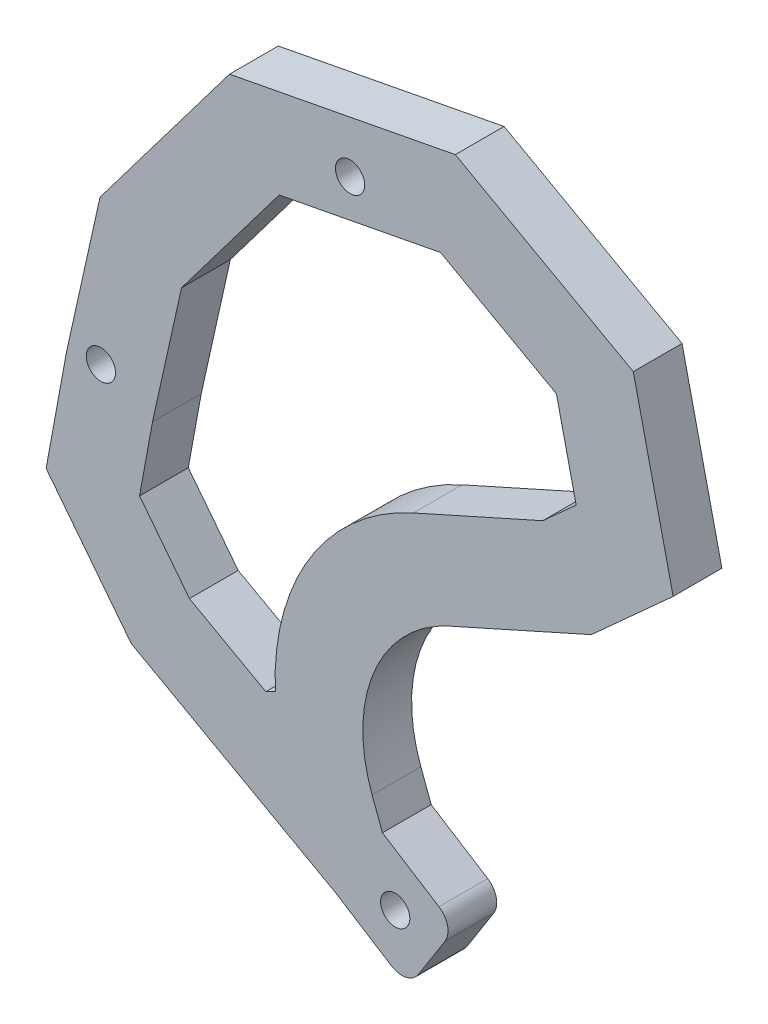
ISO-10303-21;
HEADER;
FILE_DESCRIPTION(('STEP AP214'),'2;1');
FILE_NAME('part.step','',(''),(''),'','','');
FILE_SCHEMA(('AUTOMOTIVE_DESIGN { 1 0 10303 214 1 1 1 1 }'));
ENDSEC;
DATA;
#1=APPLICATION_CONTEXT('core data for automotive mechanical design processes');
#2=APPLICATION_PROTOCOL_DEFINITION('international standard','automotive_design',2000,#1);
#3=PRODUCT_CONTEXT('',#1,'mechanical');
#4=PRODUCT('Part','Part','',(#3));
#5=PRODUCT_RELATED_PRODUCT_CATEGORY('part','',(#4));
#6=PRODUCT_DEFINITION_FORMATION('','',#4);
#7=PRODUCT_DEFINITION_CONTEXT('part definition',#1,'design');
#8=PRODUCT_DEFINITION('design','',#6,#7);
#9=PRODUCT_DEFINITION_SHAPE('','',#8);
#10=(LENGTH_UNIT() NAMED_UNIT(*) SI_UNIT(.MILLI.,.METRE.));
#11=(NAMED_UNIT(*) PLANE_ANGLE_UNIT() SI_UNIT($,.RADIAN.));
#12=(NAMED_UNIT(*) SI_UNIT($,.STERADIAN.) SOLID_ANGLE_UNIT());
#13=UNCERTAINTY_MEASURE_WITH_UNIT(LENGTH_MEASURE(1.E-05),#10,'distance_accuracy_value','');
#14=(GEOMETRIC_REPRESENTATION_CONTEXT(3) GLOBAL_UNCERTAINTY_ASSIGNED_CONTEXT((#13)) GLOBAL_UNIT_ASSIGNED_CONTEXT((#10,
#11,#12)) REPRESENTATION_CONTEXT('',''));
#15=CARTESIAN_POINT('',(0.,0.,0.));
#16=DIRECTION('',(0.,0.,1.));
#17=DIRECTION('',(1.,0.,0.));
#18=AXIS2_PLACEMENT_3D('',#15,#16,#17);
#19=CARTESIAN_POINT('',(3.11076101761809,-23.2311358919066,-22.));
#20=DIRECTION('',(-0.788604453813299,-0.614900817551765,0.));
#21=DIRECTION('',(0.614900817551765,-0.788604453813299,0.));
#22=AXIS2_PLACEMENT_3D('',#19,#20,#21);
#23=PLANE('',#22);
#24=DIRECTION('',(-0.614900817551765,0.788604453813299,0.));
#25=VECTOR('',#24,1.);
#26=CARTESIAN_POINT('',(3.11076101761809,-23.2311358919066,-27.));
#27=LINE('',#26,#25);
#28=CARTESIAN_POINT('',(3.11076101761809,-23.2311358919066,-27.));
#29=VERTEX_POINT('',#28);
#30=CARTESIAN_POINT('',(-5.61594193316147,-12.0392223057597,-27.));
#31=VERTEX_POINT('',#30);
#32=EDGE_CURVE('E397',#29,#31,#27,.T.);
#33=ORIENTED_EDGE('',*,*,#32,.F.);
#34=DIRECTION('',(0.,0.,-1.));
#35=VECTOR('',#34,1.);
#36=CARTESIAN_POINT('',(3.11076101761809,-23.2311358919066,-22.));
#37=LINE('',#36,#35);
#38=CARTESIAN_POINT('',(3.11076101761809,-23.2311358919066,-22.));
#39=VERTEX_POINT('',#38);
#40=EDGE_CURVE('E517',#39,#29,#37,.T.);
#41=ORIENTED_EDGE('',*,*,#40,.F.);
#42=DIRECTION('',(-0.614900817551765,0.788604453813299,0.));
#43=VECTOR('',#42,1.);
#44=CARTESIAN_POINT('',(3.11076101761809,-23.2311358919066,-22.));
#45=LINE('',#44,#43);
#46=CARTESIAN_POINT('',(-5.61594193316147,-12.0392223057597,-22.));
#47=VERTEX_POINT('',#46);
#48=EDGE_CURVE('E401',#39,#47,#45,.T.);
#49=ORIENTED_EDGE('',*,*,#48,.T.);
#50=DIRECTION('',(0.,0.,-1.));
#51=VECTOR('',#50,1.);
#52=CARTESIAN_POINT('',(-5.61594193316147,-12.0392223057597,-22.));
#53=LINE('',#52,#51);
#54=EDGE_CURVE('E459',#47,#31,#53,.T.);
#55=ORIENTED_EDGE('',*,*,#54,.T.);
#56=EDGE_LOOP('',(#33,#41,#49,#55));
#57=FACE_BOUND('',#56,.T.);
#58=ADVANCED_FACE('F41',(#57),#23,.T.);
#59=CARTESIAN_POINT('',(24.0092428157621,-34.8487399241226,-22.));
#60=DIRECTION('',(-0.485877374532499,-0.874026988666486,0.));
#61=DIRECTION('',(0.874026988666486,-0.485877374532499,0.));
#62=AXIS2_PLACEMENT_3D('',#59,#60,#61);
#63=PLANE('',#62);
#64=DIRECTION('',(-0.874026988666486,0.485877374532499,0.));
#65=VECTOR('',#64,1.);
#66=CARTESIAN_POINT('',(24.0092428157621,-34.8487399241226,-27.));
#67=LINE('',#66,#65);
#68=CARTESIAN_POINT('',(24.0092428157621,-34.8487399241226,-27.));
#69=VERTEX_POINT('',#68);
#70=EDGE_CURVE('E406',#69,#29,#67,.T.);
#71=ORIENTED_EDGE('',*,*,#70,.F.);
#72=DIRECTION('',(0.,0.,-1.));
#73=VECTOR('',#72,1.);
#74=CARTESIAN_POINT('',(24.0092428157621,-34.8487399241226,-22.));
#75=LINE('',#74,#73);
#76=CARTESIAN_POINT('',(24.0092428157621,-34.8487399241226,-22.));
#77=VERTEX_POINT('',#76);
#78=EDGE_CURVE('E521',#77,#69,#75,.T.);
#79=ORIENTED_EDGE('',*,*,#78,.F.);
#80=DIRECTION('',(-0.874026988666486,0.485877374532499,0.));
#81=VECTOR('',#80,1.);
#82=CARTESIAN_POINT('',(24.0092428157621,-34.8487399241226,-22.));
#83=LINE('',#82,#81);
#84=EDGE_CURVE('E455',#77,#39,#83,.T.);
#85=ORIENTED_EDGE('',*,*,#84,.T.);
#86=ORIENTED_EDGE('',*,*,#40,.T.);
#87=EDGE_LOOP('',(#71,#79,#85,#86));
#88=FACE_BOUND('',#87,.T.);
#89=ADVANCED_FACE('F598',(#88),#63,.T.);
#90=CARTESIAN_POINT('',(24.0092428157621,-34.8487399241226,-22.));
#91=DIRECTION('',(-0.535022818922781,-0.844837607609842,0.));
#92=DIRECTION('',(0.844837607609842,-0.535022818922781,0.));
#93=AXIS2_PLACEMENT_3D('',#90,#91,#92);
#94=PLANE('',#93);
#95=DIRECTION('',(-0.844837607609842,0.535022818922781,0.));
#96=VECTOR('',#95,1.);
#97=CARTESIAN_POINT('',(24.0092428157621,-34.8487399241226,-27.));
#98=LINE('',#97,#96);
#99=CARTESIAN_POINT('',(29.8035032170878,-38.5181569879065,-27.));
#100=VERTEX_POINT('',#99);
#101=EDGE_CURVE('E511',#100,#69,#98,.T.);
#102=ORIENTED_EDGE('',*,*,#101,.F.);
#103=DIRECTION('',(0.,0.,-1.));
#104=VECTOR('',#103,1.);
#105=CARTESIAN_POINT('',(29.8035032170878,-38.5181569879065,-22.));
#106=LINE('',#105,#104);
#107=CARTESIAN_POINT('',(29.8035032170878,-38.5181569879065,-22.));
#108=VERTEX_POINT('',#107);
#109=EDGE_CURVE('E11',#100,#108,#106,.F.);
#110=ORIENTED_EDGE('',*,*,#109,.T.);
#111=DIRECTION('',(-0.844837607609842,0.535022818922781,0.));
#112=VECTOR('',#111,1.);
#113=CARTESIAN_POINT('',(24.0092428157621,-34.8487399241226,-22.));
#114=LINE('',#113,#112);
#115=EDGE_CURVE('E452',#108,#77,#114,.T.);
#116=ORIENTED_EDGE('',*,*,#115,.T.);
#117=ORIENTED_EDGE('',*,*,#78,.T.);
#118=EDGE_LOOP('',(#102,#110,#116,#117));
#119=FACE_BOUND('',#118,.T.);
#120=ADVANCED_FACE('F593',(#119),#94,.T.);
#121=CARTESIAN_POINT('',(36.3629028768119,-31.8985748119372,-22.));
#122=DIRECTION('',(0.844837607609846,-0.535022818922775,0.));
#123=DIRECTION('',(0.535022818922775,0.844837607609846,0.));
#124=AXIS2_PLACEMENT_3D('',#121,#122,#123);
#125=PLANE('',#124);
#126=DIRECTION('',(-0.535022818922775,-0.844837607609846,0.));
#127=VECTOR('',#126,1.);
#128=CARTESIAN_POINT('',(36.3629028768119,-31.8985748119372,-27.));
#129=LINE('',#128,#127);
#130=CARTESIAN_POINT('',(35.2928572389663,-33.5882500271568,-27.));
#131=VERTEX_POINT('',#130);
#132=CARTESIAN_POINT('',(32.5632240701531,-37.8985274105324,-27.));
#133=VERTEX_POINT('',#132);
#134=EDGE_CURVE('E507',#131,#133,#129,.T.);
#135=ORIENTED_EDGE('',*,*,#134,.F.);
#136=DIRECTION('',(0.,0.,-1.));
#137=VECTOR('',#136,1.);
#138=CARTESIAN_POINT('',(35.2928572389663,-33.5882500271568,-22.));
#139=LINE('',#138,#137);
#140=CARTESIAN_POINT('',(35.2928572389663,-33.5882500271568,-22.));
#141=VERTEX_POINT('',#140);
#142=EDGE_CURVE('E571',#131,#141,#139,.F.);
#143=ORIENTED_EDGE('',*,*,#142,.T.);
#144=DIRECTION('',(-0.535022818922775,-0.844837607609846,0.));
#145=VECTOR('',#144,1.);
#146=CARTESIAN_POINT('',(36.3629028768119,-31.8985748119372,-22.));
#147=LINE('',#146,#145);
#148=CARTESIAN_POINT('',(32.5632240701531,-37.8985274105324,-22.));
#149=VERTEX_POINT('',#148);
#150=EDGE_CURVE('E449',#141,#149,#147,.T.);
#151=ORIENTED_EDGE('',*,*,#150,.T.);
#152=DIRECTION('',(0.,0.,-1.));
#153=VECTOR('',#152,1.);
#154=CARTESIAN_POINT('',(32.5632240701531,-37.8985274105324,-22.));
#155=LINE('',#154,#153);
#156=EDGE_CURVE('E567',#149,#133,#155,.T.);
#157=ORIENTED_EDGE('',*,*,#156,.T.);
#158=EDGE_LOOP('',(#135,#143,#151,#157));
#159=FACE_BOUND('',#158,.T.);
#160=ADVANCED_FACE('F590',(#159),#125,.T.);
#161=CARTESIAN_POINT('',(28.8789672602665,-27.1591121103077,-22.));
#162=DIRECTION('',(0.535022818922781,0.844837607609842,0.));
#163=DIRECTION('',(-0.844837607609842,0.535022818922781,0.));
#164=AXIS2_PLACEMENT_3D('',#161,#162,#163);
#165=PLANE('',#164);
#166=DIRECTION('',(0.844837607609842,-0.535022818922781,0.));
#167=VECTOR('',#166,1.);
#168=CARTESIAN_POINT('',(28.8789672602665,-27.1591121103077,-22.));
#169=LINE('',#168,#167);
#170=CARTESIAN_POINT('',(28.8789672602665,-27.1591121103077,-22.));
#171=VERTEX_POINT('',#170);
#172=CARTESIAN_POINT('',(34.6732276615922,-30.8285291740916,-22.));
#173=VERTEX_POINT('',#172);
#174=EDGE_CURVE('E445',#171,#173,#169,.T.);
#175=ORIENTED_EDGE('',*,*,#174,.T.);
#176=DIRECTION('',(0.,0.,-1.));
#177=VECTOR('',#176,1.);
#178=CARTESIAN_POINT('',(34.6732276615922,-30.8285291740916,-22.));
#179=LINE('',#178,#177);
#180=CARTESIAN_POINT('',(34.6732276615922,-30.8285291740916,-27.));
#181=VERTEX_POINT('',#180);
#182=EDGE_CURVE('E520',#173,#181,#179,.T.);
#183=ORIENTED_EDGE('',*,*,#182,.T.);
#184=DIRECTION('',(0.844837607609842,-0.535022818922781,0.));
#185=VECTOR('',#184,1.);
#186=CARTESIAN_POINT('',(28.8789672602665,-27.1591121103077,-27.));
#187=LINE('',#186,#185);
#188=CARTESIAN_POINT('',(28.8789672602665,-27.1591121103077,-27.));
#189=VERTEX_POINT('',#188);
#190=EDGE_CURVE('E503',#189,#181,#187,.T.);
#191=ORIENTED_EDGE('',*,*,#190,.F.);
#192=DIRECTION('',(0.,0.,-1.));
#193=VECTOR('',#192,1.);
#194=CARTESIAN_POINT('',(28.8789672602665,-27.1591121103077,-22.));
#195=LINE('',#194,#193);
#196=EDGE_CURVE('E525',#171,#189,#195,.T.);
#197=ORIENTED_EDGE('',*,*,#196,.F.);
#198=EDGE_LOOP('',(#175,#183,#191,#197));
#199=FACE_BOUND('',#198,.T.);
#200=ADVANCED_FACE('F583',(#199),#165,.T.);
#201=CARTESIAN_POINT('',(28.8789672602665,-27.1591121103077,-22.));
#202=DIRECTION('',(0.936590996501724,0.350424464431221,0.));
#203=DIRECTION('',(-0.350424464431221,0.936590996501724,0.));
#204=AXIS2_PLACEMENT_3D('',#201,#202,#203);
#205=PLANE('',#204);
#206=DIRECTION('',(0.350424464431221,-0.936590996501724,0.));
#207=VECTOR('',#206,1.);
#208=CARTESIAN_POINT('',(28.8789672602665,-27.1591121103077,-27.));
#209=LINE('',#208,#207);
#210=CARTESIAN_POINT('',(27.8173680449634,-24.3217409565558,-27.));
#211=VERTEX_POINT('',#210);
#212=EDGE_CURVE('E499',#211,#189,#209,.T.);
#213=ORIENTED_EDGE('',*,*,#212,.F.);
#214=DIRECTION('',(0.,0.,-1.));
#215=VECTOR('',#214,1.);
#216=CARTESIAN_POINT('',(27.8173680449634,-24.3217409565558,-22.));
#217=LINE('',#216,#215);
#218=CARTESIAN_POINT('',(27.8173680449634,-24.3217409565558,-22.));
#219=VERTEX_POINT('',#218);
#220=EDGE_CURVE('E528',#219,#211,#217,.T.);
#221=ORIENTED_EDGE('',*,*,#220,.F.);
#222=DIRECTION('',(0.350424464431221,-0.936590996501724,0.));
#223=VECTOR('',#222,1.);
#224=CARTESIAN_POINT('',(28.8789672602665,-27.1591121103077,-22.));
#225=LINE('',#224,#223);
#226=EDGE_CURVE('E441',#219,#171,#225,.T.);
#227=ORIENTED_EDGE('',*,*,#226,.T.);
#228=ORIENTED_EDGE('',*,*,#196,.T.);
#229=EDGE_LOOP('',(#213,#221,#227,#228));
#230=FACE_BOUND('',#229,.T.);
#231=ADVANCED_FACE('F640',(#230),#205,.T.);
#232=CARTESIAN_POINT('',(41.8662329924893,-19.0653739900874,-22.));
#233=DIRECTION('',(0.,0.,-1.));
#234=DIRECTION('',(-1.,0.,0.));
#235=AXIS2_PLACEMENT_3D('',#232,#233,#234);
#236=CYLINDRICAL_SURFACE('',#235,15.);
#237=CARTESIAN_POINT('',(41.8662329924893,-19.0653739900874,-27.));
#238=DIRECTION('',(0.,0.,1.));
#239=DIRECTION('',(1.,0.,0.));
#240=AXIS2_PLACEMENT_3D('',#237,#238,#239);
#241=CIRCLE('',#240,15.);
#242=CARTESIAN_POINT('',(35.7332016610253,-5.37647605463325,-27.));
#243=VERTEX_POINT('',#242);
#244=EDGE_CURVE('E495',#243,#211,#241,.T.);
#245=ORIENTED_EDGE('',*,*,#244,.F.);
#246=DIRECTION('',(0.,0.,-1.));
#247=VECTOR('',#246,1.);
#248=CARTESIAN_POINT('',(35.7332016610253,-5.37647605463325,-22.));
#249=LINE('',#248,#247);
#250=CARTESIAN_POINT('',(35.7332016610253,-5.37647605463325,-22.));
#251=VERTEX_POINT('',#250);
#252=EDGE_CURVE('E531',#251,#243,#249,.T.);
#253=ORIENTED_EDGE('',*,*,#252,.F.);
#254=CARTESIAN_POINT('',(41.8662329924893,-19.0653739900874,-22.));
#255=DIRECTION('',(0.,0.,1.));
#256=DIRECTION('',(1.,0.,0.));
#257=AXIS2_PLACEMENT_3D('',#254,#255,#256);
#258=CIRCLE('',#257,15.);
#259=EDGE_CURVE('E437',#251,#219,#258,.T.);
#260=ORIENTED_EDGE('',*,*,#259,.T.);
#261=ORIENTED_EDGE('',*,*,#220,.T.);
#262=EDGE_LOOP('',(#245,#253,#260,#261));
#263=FACE_BOUND('',#262,.T.);
#264=ADVANCED_FACE('F637',(#263),#236,.F.);
#265=CARTESIAN_POINT('',(35.7332016610253,-5.37647605463325,-22.));
#266=DIRECTION('',(0.408868755430929,-0.912593195696945,0.));
#267=DIRECTION('',(0.912593195696946,0.408868755430929,0.));
#268=AXIS2_PLACEMENT_3D('',#265,#266,#267);
#269=PLANE('',#268);
#270=DIRECTION('',(-0.912593195696945,-0.408868755430929,0.));
#271=VECTOR('',#270,1.);
#272=CARTESIAN_POINT('',(35.7332016610253,-5.37647605463325,-27.));
#273=LINE('',#272,#271);
#274=CARTESIAN_POINT('',(50.3043157435836,1.15181421563093,-27.));
#275=VERTEX_POINT('',#274);
#276=EDGE_CURVE('E491',#275,#243,#273,.T.);
#277=ORIENTED_EDGE('',*,*,#276,.F.);
#278=DIRECTION('',(0.,0.,-1.));
#279=VECTOR('',#278,1.);
#280=CARTESIAN_POINT('',(50.3043157435836,1.15181421563093,-22.));
#281=LINE('',#280,#279);
#282=CARTESIAN_POINT('',(50.3043157435836,1.15181421563093,-22.));
#283=VERTEX_POINT('',#282);
#284=EDGE_CURVE('E534',#283,#275,#281,.T.);
#285=ORIENTED_EDGE('',*,*,#284,.F.);
#286=DIRECTION('',(-0.912593195696945,-0.408868755430929,0.));
#287=VECTOR('',#286,1.);
#288=CARTESIAN_POINT('',(35.7332016610253,-5.37647605463325,-22.));
#289=LINE('',#288,#287);
#290=EDGE_CURVE('E433',#283,#251,#289,.T.);
#291=ORIENTED_EDGE('',*,*,#290,.T.);
#292=ORIENTED_EDGE('',*,*,#252,.T.);
#293=EDGE_LOOP('',(#277,#285,#291,#292));
#294=FACE_BOUND('',#293,.T.);
#295=ADVANCED_FACE('F633',(#294),#269,.T.);
#296=CARTESIAN_POINT('',(58.6927186922009,8.73902408234267,-22.));
#297=DIRECTION('',(0.670801618806378,-0.741636830400663,0.));
#298=DIRECTION('',(0.741636830400664,0.670801618806378,0.));
#299=AXIS2_PLACEMENT_3D('',#296,#297,#298);
#300=PLANE('',#299);
#301=DIRECTION('',(-0.741636830400663,-0.670801618806378,0.));
#302=VECTOR('',#301,1.);
#303=CARTESIAN_POINT('',(58.6927186922009,8.73902408234267,-27.));
#304=LINE('',#303,#302);
#305=CARTESIAN_POINT('',(58.6927186922009,8.73902408234267,-27.));
#306=VERTEX_POINT('',#305);
#307=EDGE_CURVE('E487',#306,#275,#304,.T.);
#308=ORIENTED_EDGE('',*,*,#307,.F.);
#309=DIRECTION('',(0.,0.,-1.));
#310=VECTOR('',#309,1.);
#311=CARTESIAN_POINT('',(58.6927186922009,8.73902408234267,-22.));
#312=LINE('',#311,#310);
#313=CARTESIAN_POINT('',(58.6927186922009,8.73902408234267,-22.));
#314=VERTEX_POINT('',#313);
#315=EDGE_CURVE('E537',#314,#306,#312,.T.);
#316=ORIENTED_EDGE('',*,*,#315,.F.);
#317=DIRECTION('',(-0.741636830400663,-0.670801618806378,0.));
#318=VECTOR('',#317,1.);
#319=CARTESIAN_POINT('',(58.6927186922009,8.73902408234267,-22.));
#320=LINE('',#319,#318);
#321=EDGE_CURVE('E429',#314,#283,#320,.T.);
#322=ORIENTED_EDGE('',*,*,#321,.T.);
#323=ORIENTED_EDGE('',*,*,#284,.T.);
#324=EDGE_LOOP('',(#308,#316,#322,#323));
#325=FACE_BOUND('',#324,.T.);
#326=ADVANCED_FACE('F631',(#325),#300,.T.);
#327=CARTESIAN_POINT('',(54.6075140618315,26.6648882923588,-22.));
#328=DIRECTION('',(0.975001687650077,0.222197455159822,0.));
#329=DIRECTION('',(-0.222197455159822,0.975001687650078,0.));
#330=AXIS2_PLACEMENT_3D('',#327,#328,#329);
#331=PLANE('',#330);
#332=DIRECTION('',(0.222197455159822,-0.975001687650077,0.));
#333=VECTOR('',#332,1.);
#334=CARTESIAN_POINT('',(54.6075140618315,26.6648882923588,-27.));
#335=LINE('',#334,#333);
#336=CARTESIAN_POINT('',(54.6075140618315,26.6648882923588,-27.));
#337=VERTEX_POINT('',#336);
#338=EDGE_CURVE('E483',#337,#306,#335,.T.);
#339=ORIENTED_EDGE('',*,*,#338,.F.);
#340=DIRECTION('',(0.,0.,-1.));
#341=VECTOR('',#340,1.);
#342=CARTESIAN_POINT('',(54.6075140618315,26.6648882923588,-22.));
#343=LINE('',#342,#341);
#344=CARTESIAN_POINT('',(54.6075140618315,26.6648882923588,-22.));
#345=VERTEX_POINT('',#344);
#346=EDGE_CURVE('E540',#345,#337,#343,.T.);
#347=ORIENTED_EDGE('',*,*,#346,.F.);
#348=DIRECTION('',(0.222197455159822,-0.975001687650077,0.));
#349=VECTOR('',#348,1.);
#350=CARTESIAN_POINT('',(54.6075140618315,26.6648882923588,-22.));
#351=LINE('',#350,#349);
#352=EDGE_CURVE('E425',#345,#314,#351,.T.);
#353=ORIENTED_EDGE('',*,*,#352,.T.);
#354=ORIENTED_EDGE('',*,*,#315,.T.);
#355=EDGE_LOOP('',(#339,#347,#353,#354));
#356=FACE_BOUND('',#355,.T.);
#357=ADVANCED_FACE('F627',(#356),#331,.T.);
#358=CARTESIAN_POINT('',(41.1617831534891,34.139458891584,-22.));
#359=DIRECTION('',(0.485877374532499,0.874026988666486,0.));
#360=DIRECTION('',(-0.874026988666486,0.485877374532499,0.));
#361=AXIS2_PLACEMENT_3D('',#358,#359,#360);
#362=PLANE('',#361);
#363=DIRECTION('',(0.874026988666486,-0.485877374532499,0.));
#364=VECTOR('',#363,1.);
#365=CARTESIAN_POINT('',(41.1617831534891,34.139458891584,-27.));
#366=LINE('',#365,#364);
#367=CARTESIAN_POINT('',(36.353236664413,36.8125616375237,-27.));
#368=VERTEX_POINT('',#367);
#369=EDGE_CURVE('E479',#368,#337,#366,.T.);
#370=ORIENTED_EDGE('',*,*,#369,.F.);
#371=DIRECTION('',(0.,0.,-1.));
#372=VECTOR('',#371,1.);
#373=CARTESIAN_POINT('',(36.353236664413,36.8125616375237,-22.));
#374=LINE('',#373,#372);
#375=CARTESIAN_POINT('',(36.353236664413,36.8125616375237,-22.));
#376=VERTEX_POINT('',#375);
#377=EDGE_CURVE('E543',#376,#368,#374,.T.);
#378=ORIENTED_EDGE('',*,*,#377,.F.);
#379=DIRECTION('',(0.874026988666487,-0.485877374532498,0.));
#380=VECTOR('',#379,1.);
#381=CARTESIAN_POINT('',(36.353236664413,36.8125616375237,-22.));
#382=LINE('',#381,#380);
#383=EDGE_CURVE('E422',#376,#345,#382,.T.);
#384=ORIENTED_EDGE('',*,*,#383,.T.);
#385=ORIENTED_EDGE('',*,*,#346,.T.);
#386=EDGE_LOOP('',(#370,#378,#384,#385));
#387=FACE_BOUND('',#386,.T.);
#388=ADVANCED_FACE('F620',(#387),#362,.T.);
#389=CARTESIAN_POINT('',(13.1949887198028,32.3817916564181,-22.));
#390=DIRECTION('',(-0.18791728927867,0.982184856526589,0.));
#391=DIRECTION('',(-0.982184856526589,-0.18791728927867,0.));
#392=AXIS2_PLACEMENT_3D('',#389,#390,#391);
#393=PLANE('',#392);
#394=DIRECTION('',(0.982184856526589,0.18791728927867,0.));
#395=VECTOR('',#394,1.);
#396=CARTESIAN_POINT('',(13.1949887198028,32.3817916564181,-27.));
#397=LINE('',#396,#395);
#398=CARTESIAN_POINT('',(13.1949887198028,32.3817916564181,-27.));
#399=VERTEX_POINT('',#398);
#400=EDGE_CURVE('E475',#399,#368,#397,.T.);
#401=ORIENTED_EDGE('',*,*,#400,.F.);
#402=DIRECTION('',(0.,0.,-1.));
#403=VECTOR('',#402,1.);
#404=CARTESIAN_POINT('',(13.1949887198028,32.3817916564181,-22.));
#405=LINE('',#404,#403);
#406=CARTESIAN_POINT('',(13.1949887198028,32.3817916564181,-22.));
#407=VERTEX_POINT('',#406);
#408=EDGE_CURVE('E547',#407,#399,#405,.T.);
#409=ORIENTED_EDGE('',*,*,#408,.F.);
#410=DIRECTION('',(0.982184856526589,0.18791728927867,0.));
#411=VECTOR('',#410,1.);
#412=CARTESIAN_POINT('',(13.1949887198028,32.3817916564181,-22.));
#413=LINE('',#412,#411);
#414=EDGE_CURVE('E418',#407,#376,#413,.T.);
#415=ORIENTED_EDGE('',*,*,#414,.T.);
#416=ORIENTED_EDGE('',*,*,#377,.T.);
#417=EDGE_LOOP('',(#401,#409,#415,#416));
#418=FACE_BOUND('',#417,.T.);
#419=ADVANCED_FACE('F617',(#418),#393,.T.);
#420=CARTESIAN_POINT('',(-0.0861796624880787,14.8124878533497,-22.));
#421=DIRECTION('',(-0.797723531197256,0.603023355911013,0.));
#422=DIRECTION('',(-0.603023355911013,-0.797723531197256,0.));
#423=AXIS2_PLACEMENT_3D('',#420,#421,#422);
#424=PLANE('',#423);
#425=DIRECTION('',(0.603023355911013,0.797723531197256,0.));
#426=VECTOR('',#425,1.);
#427=CARTESIAN_POINT('',(-0.0861796624880787,14.8124878533497,-27.));
#428=LINE('',#427,#426);
#429=CARTESIAN_POINT('',(-0.0861796624880787,14.8124878533497,-27.));
#430=VERTEX_POINT('',#429);
#431=EDGE_CURVE('E471',#430,#399,#428,.T.);
#432=ORIENTED_EDGE('',*,*,#431,.F.);
#433=DIRECTION('',(0.,0.,-1.));
#434=VECTOR('',#433,1.);
#435=CARTESIAN_POINT('',(-0.0861796624880787,14.8124878533497,-22.));
#436=LINE('',#435,#434);
#437=CARTESIAN_POINT('',(-0.0861796624880787,14.8124878533497,-22.));
#438=VERTEX_POINT('',#437);
#439=EDGE_CURVE('E550',#438,#430,#436,.T.);
#440=ORIENTED_EDGE('',*,*,#439,.F.);
#441=DIRECTION('',(0.603023355911013,0.797723531197256,0.));
#442=VECTOR('',#441,1.);
#443=CARTESIAN_POINT('',(-0.0861796624880787,14.8124878533497,-22.));
#444=LINE('',#443,#442);
#445=EDGE_CURVE('E414',#438,#407,#444,.T.);
#446=ORIENTED_EDGE('',*,*,#445,.T.);
#447=ORIENTED_EDGE('',*,*,#408,.T.);
#448=EDGE_LOOP('',(#432,#440,#446,#447));
#449=FACE_BOUND('',#448,.T.);
#450=ADVANCED_FACE('F613',(#449),#424,.T.);
#451=CARTESIAN_POINT('',(-3.52607976147876,-0.656528436617745,-22.));
#452=DIRECTION('',(-0.976155767839237,0.217071225440384,0.));
#453=DIRECTION('',(-0.217071225440384,-0.976155767839237,0.));
#454=AXIS2_PLACEMENT_3D('',#451,#452,#453);
#455=PLANE('',#454);
#456=DIRECTION('',(0.217071225440384,0.976155767839237,0.));
#457=VECTOR('',#456,1.);
#458=CARTESIAN_POINT('',(-3.52607976147876,-0.656528436617745,-27.));
#459=LINE('',#458,#457);
#460=CARTESIAN_POINT('',(-3.52607976147876,-0.656528436617745,-27.));
#461=VERTEX_POINT('',#460);
#462=EDGE_CURVE('E467',#461,#430,#459,.T.);
#463=ORIENTED_EDGE('',*,*,#462,.F.);
#464=DIRECTION('',(0.,0.,-1.));
#465=VECTOR('',#464,1.);
#466=CARTESIAN_POINT('',(-3.52607976147876,-0.656528436617745,-22.));
#467=LINE('',#466,#465);
#468=CARTESIAN_POINT('',(-3.52607976147876,-0.656528436617745,-22.));
#469=VERTEX_POINT('',#468);
#470=EDGE_CURVE('E553',#469,#461,#467,.T.);
#471=ORIENTED_EDGE('',*,*,#470,.F.);
#472=DIRECTION('',(0.217071225440384,0.976155767839237,0.));
#473=VECTOR('',#472,1.);
#474=CARTESIAN_POINT('',(-3.52607976147876,-0.656528436617745,-22.));
#475=LINE('',#474,#473);
#476=EDGE_CURVE('E410',#469,#438,#475,.T.);
#477=ORIENTED_EDGE('',*,*,#476,.T.);
#478=ORIENTED_EDGE('',*,*,#439,.T.);
#479=EDGE_LOOP('',(#463,#471,#477,#478));
#480=FACE_BOUND('',#479,.T.);
#481=ADVANCED_FACE('F609',(#480),#455,.T.);
#482=CARTESIAN_POINT('',(-5.61594193316147,-12.0392223057597,-22.));
#483=DIRECTION('',(-0.983560009616262,0.180581581241441,0.));
#484=DIRECTION('',(-0.180581581241441,-0.983560009616262,0.));
#485=AXIS2_PLACEMENT_3D('',#482,#483,#484);
#486=PLANE('',#485);
#487=DIRECTION('',(0.180581581241441,0.983560009616262,0.));
#488=VECTOR('',#487,1.);
#489=CARTESIAN_POINT('',(-5.61594193316147,-12.0392223057597,-27.));
#490=LINE('',#489,#488);
#491=EDGE_CURVE('E463',#31,#461,#490,.T.);
#492=ORIENTED_EDGE('',*,*,#491,.F.);
#493=ORIENTED_EDGE('',*,*,#54,.F.);
#494=DIRECTION('',(0.180581581241441,0.983560009616262,0.));
#495=VECTOR('',#494,1.);
#496=CARTESIAN_POINT('',(-5.61594193316147,-12.0392223057597,-22.));
#497=LINE('',#496,#495);
#498=EDGE_CURVE('E405',#47,#469,#497,.T.);
#499=ORIENTED_EDGE('',*,*,#498,.T.);
#500=ORIENTED_EDGE('',*,*,#470,.T.);
#501=EDGE_LOOP('',(#492,#493,#499,#500));
#502=FACE_BOUND('',#501,.T.);
#503=ADVANCED_FACE('F605',(#502),#486,.T.);
#504=CARTESIAN_POINT('',(41.8662329924893,-19.0653739900874,-22.));
#505=DIRECTION('',(0.,0.,1.));
#506=DIRECTION('',(1.,0.,0.));
#507=AXIS2_PLACEMENT_3D('',#504,#505,#506);
#508=PLANE('',#507);
#509=DIRECTION('',(-0.614900817551764,0.788604453813299,0.));
#510=VECTOR('',#509,1.);
#511=CARTESIAN_POINT('',(9.08301279535454,-16.2539852257807,-22.));
#512=LINE('',#511,#510);
#513=CARTESIAN_POINT('',(9.08301279535454,-16.2539852257807,-22.));
#514=VERTEX_POINT('',#513);
#515=CARTESIAN_POINT('',(3.96562707211308,-9.69098667701218,-22.));
#516=VERTEX_POINT('',#515);
#517=EDGE_CURVE('E237',#514,#516,#512,.T.);
#518=ORIENTED_EDGE('',*,*,#517,.T.);
#519=DIRECTION('',(0.180581581241441,0.983560009616262,0.));
#520=VECTOR('',#519,1.);
#521=CARTESIAN_POINT('',(3.96562707211308,-9.69098667701218,-22.));
#522=LINE('',#521,#520);
#523=CARTESIAN_POINT('',(5.29569868227343,-2.44658646362315,-22.));
#524=VERTEX_POINT('',#523);
#525=EDGE_CURVE('E250',#516,#524,#522,.T.);
#526=ORIENTED_EDGE('',*,*,#525,.T.);
#527=DIRECTION('',(0.217071225440385,0.976155767839237,0.));
#528=VECTOR('',#527,1.);
#529=CARTESIAN_POINT('',(5.29569868227343,-2.44658646362315,-22.));
#530=LINE('',#529,#528);
#531=CARTESIAN_POINT('',(8.27415842454964,10.947361309977,-22.));
#532=VERTEX_POINT('',#531);
#533=EDGE_CURVE('E255',#524,#532,#530,.T.);
#534=ORIENTED_EDGE('',*,*,#533,.T.);
#535=DIRECTION('',(0.603023355911013,0.797723531197256,0.));
#536=VECTOR('',#535,1.);
#537=CARTESIAN_POINT('',(8.27415842454964,10.947361309977,-22.));
#538=LINE('',#537,#536);
#539=CARTESIAN_POINT('',(18.2867327031694,24.1927290583765,-22.));
#540=VERTEX_POINT('',#539);
#541=EDGE_CURVE('E271',#532,#540,#538,.T.);
#542=ORIENTED_EDGE('',*,*,#541,.T.);
#543=DIRECTION('',(0.982184856526589,0.18791728927867,0.));
#544=VECTOR('',#543,1.);
#545=CARTESIAN_POINT('',(18.2867327031694,24.1927290583765,-22.));
#546=LINE('',#545,#544);
#547=CARTESIAN_POINT('',(34.8357430875631,27.3589814710614,-22.));
#548=VERTEX_POINT('',#547);
#549=EDGE_CURVE('E275',#540,#548,#546,.T.);
#550=ORIENTED_EDGE('',*,*,#549,.T.);
#551=DIRECTION('',(0.874026988666487,-0.485877374532498,0.));
#552=VECTOR('',#551,1.);
#553=CARTESIAN_POINT('',(34.8357430875631,27.3589814710614,-22.));
#554=LINE('',#553,#552);
#555=CARTESIAN_POINT('',(46.7247792852562,20.7497877409337,-22.));
#556=VERTEX_POINT('',#555);
#557=EDGE_CURVE('E279',#548,#556,#554,.T.);
#558=ORIENTED_EDGE('',*,*,#557,.T.);
#559=DIRECTION('',(0.222197455159822,-0.975001687650077,0.));
#560=VECTOR('',#559,1.);
#561=CARTESIAN_POINT('',(46.7247792852562,20.7497877409337,-22.));
#562=LINE('',#561,#560);
#563=CARTESIAN_POINT('',(48.7465710105034,11.8781724347408,-22.));
#564=VERTEX_POINT('',#563);
#565=EDGE_CURVE('E283',#556,#564,#562,.T.);
#566=ORIENTED_EDGE('',*,*,#565,.T.);
#567=DIRECTION('',(-0.741636830400663,-0.670801618806378,0.));
#568=VECTOR('',#567,1.);
#569=CARTESIAN_POINT('',(48.7465710105034,11.8781724347408,-22.));
#570=LINE('',#569,#568);
#571=CARTESIAN_POINT('',(45.323986552757,8.78248583902854,-22.));
#572=VERTEX_POINT('',#571);
#573=EDGE_CURVE('E287',#564,#572,#570,.T.);
#574=ORIENTED_EDGE('',*,*,#573,.T.);
#575=DIRECTION('',(-0.912593195696945,-0.408868755430929,0.));
#576=VECTOR('',#575,1.);
#577=CARTESIAN_POINT('',(32.053382862147,2.83686270663925,-22.));
#578=LINE('',#577,#576);
#579=CARTESIAN_POINT('',(32.053382862147,2.83686270663926,-22.));
#580=VERTEX_POINT('',#579);
#581=EDGE_CURVE('E291',#572,#580,#578,.T.);
#582=ORIENTED_EDGE('',*,*,#581,.T.);
#583=CARTESIAN_POINT('',(41.8662329924893,-19.0653739900874,-22.));
#584=DIRECTION('',(0.,0.,1.));
#585=DIRECTION('',(1.,0.,0.));
#586=AXIS2_PLACEMENT_3D('',#583,#584,#585);
#587=CIRCLE('',#586,24.);
#588=CARTESIAN_POINT('',(17.8880691844838,-20.0889268204082,-22.));
#589=VERTEX_POINT('',#588);
#590=EDGE_CURVE('E295',#580,#589,#587,.T.);
#591=ORIENTED_EDGE('',*,*,#590,.T.);
#592=DIRECTION('',(-0.882309203337114,-0.470670234566227,0.));
#593=VECTOR('',#592,1.);
#594=CARTESIAN_POINT('',(16.9151602614818,-20.6079277208509,-22.));
#595=LINE('',#594,#593);
#596=CARTESIAN_POINT('',(16.9151602614818,-20.6079277208509,-22.));
#597=VERTEX_POINT('',#596);
#598=EDGE_CURVE('E299',#589,#597,#595,.T.);
#599=ORIENTED_EDGE('',*,*,#598,.T.);
#600=DIRECTION('',(-0.874026988666486,0.485877374532498,0.));
#601=VECTOR('',#600,1.);
#602=CARTESIAN_POINT('',(16.9151602614818,-20.6079277208509,-22.));
#603=LINE('',#602,#601);
#604=EDGE_CURVE('E246',#597,#514,#603,.T.);
#605=ORIENTED_EDGE('',*,*,#604,.T.);
#606=EDGE_LOOP('',(#518,#526,#534,#542,#550,#558,#566,#574,#582,#591,#599,#605));
#607=FACE_BOUND('',#606,.T.);
#608=CARTESIAN_POINT('',(25.5602652313323,29.4562869571836,-22.));
#609=DIRECTION('',(0.,0.,-1.));
#610=DIRECTION('',(-1.,0.,0.));
#611=AXIS2_PLACEMENT_3D('',#608,#609,#610);
#612=CIRCLE('',#611,1.5);
#613=CARTESIAN_POINT('',(24.0602652313323,29.4562869571836,-22.));
#614=VERTEX_POINT('',#613);
#615=EDGE_CURVE('E377',#614,#614,#612,.T.);
#616=ORIENTED_EDGE('',*,*,#615,.T.);
#617=EDGE_LOOP('',(#616));
#618=FACE_BOUND('',#617,.T.);
#619=CARTESIAN_POINT('',(0.,0.,-22.));
#620=DIRECTION('',(0.,0.,-1.));
#621=DIRECTION('',(-1.,0.,0.));
#622=AXIS2_PLACEMENT_3D('',#619,#620,#621);
#623=CIRCLE('',#622,1.5);
#624=CARTESIAN_POINT('',(-1.5,0.,-22.));
#625=VERTEX_POINT('',#624);
#626=EDGE_CURVE('E385',#625,#625,#623,.T.);
#627=ORIENTED_EDGE('',*,*,#626,.T.);
#628=EDGE_LOOP('',(#627));
#629=FACE_BOUND('',#628,.T.);
#630=CARTESIAN_POINT('',(30.186072846287,-33.3736573680299,-22.));
#631=DIRECTION('',(0.,0.,-1.));
#632=DIRECTION('',(-1.,0.,0.));
#633=AXIS2_PLACEMENT_3D('',#630,#631,#632);
#634=CIRCLE('',#633,1.5);
#635=CARTESIAN_POINT('',(28.686072846287,-33.3736573680299,-22.));
#636=VERTEX_POINT('',#635);
#637=EDGE_CURVE('E393',#636,#636,#634,.T.);
#638=ORIENTED_EDGE('',*,*,#637,.T.);
#639=EDGE_LOOP('',(#638));
#640=FACE_BOUND('',#639,.T.);
#641=ORIENTED_EDGE('',*,*,#150,.F.);
#642=CARTESIAN_POINT('',(33.6031820237466,-32.5182043893113,-22.));
#643=DIRECTION('',(0.,0.,1.));
#644=DIRECTION('',(1.,0.,0.));
#645=AXIS2_PLACEMENT_3D('',#642,#643,#644);
#646=CIRCLE('',#645,2.);
#647=EDGE_CURVE('E50',#141,#173,#646,.T.);
#648=ORIENTED_EDGE('',*,*,#647,.T.);
#649=ORIENTED_EDGE('',*,*,#174,.F.);
#650=ORIENTED_EDGE('',*,*,#226,.F.);
#651=ORIENTED_EDGE('',*,*,#259,.F.);
#652=ORIENTED_EDGE('',*,*,#290,.F.);
#653=ORIENTED_EDGE('',*,*,#321,.F.);
#654=ORIENTED_EDGE('',*,*,#352,.F.);
#655=ORIENTED_EDGE('',*,*,#383,.F.);
#656=ORIENTED_EDGE('',*,*,#414,.F.);
#657=ORIENTED_EDGE('',*,*,#445,.F.);
#658=ORIENTED_EDGE('',*,*,#476,.F.);
#659=ORIENTED_EDGE('',*,*,#498,.F.);
#660=ORIENTED_EDGE('',*,*,#48,.F.);
#661=ORIENTED_EDGE('',*,*,#84,.F.);
#662=ORIENTED_EDGE('',*,*,#115,.F.);
#663=CARTESIAN_POINT('',(30.8735488549334,-36.8284817726869,-22.));
#664=DIRECTION('',(0.,0.,1.));
#665=DIRECTION('',(1.,0.,0.));
#666=AXIS2_PLACEMENT_3D('',#663,#664,#665);
#667=CIRCLE('',#666,2.);
#668=EDGE_CURVE('E62',#108,#149,#667,.T.);
#669=ORIENTED_EDGE('',*,*,#668,.T.);
#670=EDGE_LOOP('',(#641,#648,#649,#650,#651,#652,#653,#654,#655,#656,#657,#658,#659,#660,#661,
#662,#669));
#671=FACE_BOUND('',#670,.T.);
#672=ADVANCED_FACE('F257',(#607,#618,#629,#640,#671),#508,.T.);
#673=CARTESIAN_POINT('',(41.8662329924893,-19.0653739900874,-27.));
#674=DIRECTION('',(0.,0.,1.));
#675=DIRECTION('',(1.,0.,0.));
#676=AXIS2_PLACEMENT_3D('',#673,#674,#675);
#677=PLANE('',#676);
#678=DIRECTION('',(0.180581581241441,0.983560009616262,0.));
#679=VECTOR('',#678,1.);
#680=CARTESIAN_POINT('',(3.96562707211308,-9.69098667701218,-27.));
#681=LINE('',#680,#679);
#682=CARTESIAN_POINT('',(3.96562707211308,-9.69098667701218,-27.));
#683=VERTEX_POINT('',#682);
#684=CARTESIAN_POINT('',(5.29569868227343,-2.44658646362315,-27.));
#685=VERTEX_POINT('',#684);
#686=EDGE_CURVE('E306',#683,#685,#681,.T.);
#687=ORIENTED_EDGE('',*,*,#686,.F.);
#688=DIRECTION('',(-0.614900817551764,0.788604453813299,0.));
#689=VECTOR('',#688,1.);
#690=CARTESIAN_POINT('',(9.08301279535454,-16.2539852257807,-27.));
#691=LINE('',#690,#689);
#692=CARTESIAN_POINT('',(9.08301279535454,-16.2539852257807,-27.));
#693=VERTEX_POINT('',#692);
#694=EDGE_CURVE('E240',#693,#683,#691,.T.);
#695=ORIENTED_EDGE('',*,*,#694,.F.);
#696=DIRECTION('',(-0.874026988666486,0.485877374532498,0.));
#697=VECTOR('',#696,1.);
#698=CARTESIAN_POINT('',(16.9151602614818,-20.6079277208509,-27.));
#699=LINE('',#698,#697);
#700=CARTESIAN_POINT('',(16.9151602614818,-20.6079277208509,-27.));
#701=VERTEX_POINT('',#700);
#702=EDGE_CURVE('E262',#701,#693,#699,.T.);
#703=ORIENTED_EDGE('',*,*,#702,.F.);
#704=DIRECTION('',(-0.882309203337114,-0.470670234566227,0.));
#705=VECTOR('',#704,1.);
#706=CARTESIAN_POINT('',(16.9151602614818,-20.6079277208509,-27.));
#707=LINE('',#706,#705);
#708=CARTESIAN_POINT('',(17.8880691844838,-20.0889268204082,-27.));
#709=VERTEX_POINT('',#708);
#710=EDGE_CURVE('E266',#709,#701,#707,.T.);
#711=ORIENTED_EDGE('',*,*,#710,.F.);
#712=CARTESIAN_POINT('',(41.8662329924893,-19.0653739900874,-27.));
#713=DIRECTION('',(0.,0.,1.));
#714=DIRECTION('',(1.,0.,0.));
#715=AXIS2_PLACEMENT_3D('',#712,#713,#714);
#716=CIRCLE('',#715,24.);
#717=CARTESIAN_POINT('',(32.053382862147,2.83686270663926,-27.));
#718=VERTEX_POINT('',#717);
#719=EDGE_CURVE('E337',#718,#709,#716,.T.);
#720=ORIENTED_EDGE('',*,*,#719,.F.);
#721=DIRECTION('',(-0.912593195696945,-0.408868755430929,0.));
#722=VECTOR('',#721,1.);
#723=CARTESIAN_POINT('',(32.053382862147,2.83686270663925,-27.));
#724=LINE('',#723,#722);
#725=CARTESIAN_POINT('',(45.323986552757,8.78248583902854,-27.));
#726=VERTEX_POINT('',#725);
#727=EDGE_CURVE('E333',#726,#718,#724,.T.);
#728=ORIENTED_EDGE('',*,*,#727,.F.);
#729=DIRECTION('',(-0.741636830400663,-0.670801618806378,0.));
#730=VECTOR('',#729,1.);
#731=CARTESIAN_POINT('',(48.7465710105034,11.8781724347408,-27.));
#732=LINE('',#731,#730);
#733=CARTESIAN_POINT('',(48.7465710105034,11.8781724347408,-27.));
#734=VERTEX_POINT('',#733);
#735=EDGE_CURVE('E329',#734,#726,#732,.T.);
#736=ORIENTED_EDGE('',*,*,#735,.F.);
#737=DIRECTION('',(0.222197455159822,-0.975001687650077,0.));
#738=VECTOR('',#737,1.);
#739=CARTESIAN_POINT('',(46.7247792852562,20.7497877409337,-27.));
#740=LINE('',#739,#738);
#741=CARTESIAN_POINT('',(46.7247792852562,20.7497877409337,-27.));
#742=VERTEX_POINT('',#741);
#743=EDGE_CURVE('E325',#742,#734,#740,.T.);
#744=ORIENTED_EDGE('',*,*,#743,.F.);
#745=DIRECTION('',(0.874026988666486,-0.485877374532498,0.));
#746=VECTOR('',#745,1.);
#747=CARTESIAN_POINT('',(36.7888867826966,26.2732159935856,-27.));
#748=LINE('',#747,#746);
#749=CARTESIAN_POINT('',(34.8357430875631,27.3589814710614,-27.));
#750=VERTEX_POINT('',#749);
#751=EDGE_CURVE('E321',#750,#742,#748,.T.);
#752=ORIENTED_EDGE('',*,*,#751,.F.);
#753=DIRECTION('',(0.982184856526589,0.18791728927867,0.));
#754=VECTOR('',#753,1.);
#755=CARTESIAN_POINT('',(18.2867327031694,24.1927290583765,-27.));
#756=LINE('',#755,#754);
#757=CARTESIAN_POINT('',(18.2867327031694,24.1927290583765,-27.));
#758=VERTEX_POINT('',#757);
#759=EDGE_CURVE('E317',#758,#750,#756,.T.);
#760=ORIENTED_EDGE('',*,*,#759,.F.);
#761=DIRECTION('',(0.603023355911013,0.797723531197256,0.));
#762=VECTOR('',#761,1.);
#763=CARTESIAN_POINT('',(8.27415842454964,10.947361309977,-27.));
#764=LINE('',#763,#762);
#765=CARTESIAN_POINT('',(8.27415842454964,10.947361309977,-27.));
#766=VERTEX_POINT('',#765);
#767=EDGE_CURVE('E313',#766,#758,#764,.T.);
#768=ORIENTED_EDGE('',*,*,#767,.F.);
#769=DIRECTION('',(0.217071225440385,0.976155767839237,0.));
#770=VECTOR('',#769,1.);
#771=CARTESIAN_POINT('',(5.29569868227343,-2.44658646362315,-27.));
#772=LINE('',#771,#770);
#773=EDGE_CURVE('E309',#685,#766,#772,.T.);
#774=ORIENTED_EDGE('',*,*,#773,.F.);
#775=EDGE_LOOP('',(#687,#695,#703,#711,#720,#728,#736,#744,#752,#760,#768,#774));
#776=FACE_BOUND('',#775,.T.);
#777=CARTESIAN_POINT('',(25.5602652313323,29.4562869571836,-27.));
#778=DIRECTION('',(0.,0.,-1.));
#779=DIRECTION('',(-1.,0.,0.));
#780=AXIS2_PLACEMENT_3D('',#777,#778,#779);
#781=CIRCLE('',#780,1.5);
#782=CARTESIAN_POINT('',(24.0602652313323,29.4562869571836,-27.));
#783=VERTEX_POINT('',#782);
#784=EDGE_CURVE('E347',#783,#783,#781,.T.);
#785=ORIENTED_EDGE('',*,*,#784,.F.);
#786=EDGE_LOOP('',(#785));
#787=FACE_BOUND('',#786,.T.);
#788=CARTESIAN_POINT('',(0.,0.,-27.));
#789=DIRECTION('',(0.,0.,-1.));
#790=DIRECTION('',(-1.,0.,0.));
#791=AXIS2_PLACEMENT_3D('',#788,#789,#790);
#792=CIRCLE('',#791,1.5);
#793=CARTESIAN_POINT('',(-1.5,0.,-27.));
#794=VERTEX_POINT('',#793);
#795=EDGE_CURVE('E381',#794,#794,#792,.T.);
#796=ORIENTED_EDGE('',*,*,#795,.F.);
#797=EDGE_LOOP('',(#796));
#798=FACE_BOUND('',#797,.T.);
#799=CARTESIAN_POINT('',(30.186072846287,-33.3736573680299,-27.));
#800=DIRECTION('',(0.,0.,-1.));
#801=DIRECTION('',(-1.,0.,0.));
#802=AXIS2_PLACEMENT_3D('',#799,#800,#801);
#803=CIRCLE('',#802,1.5);
#804=CARTESIAN_POINT('',(28.686072846287,-33.3736573680299,-27.));
#805=VERTEX_POINT('',#804);
#806=EDGE_CURVE('E389',#805,#805,#803,.T.);
#807=ORIENTED_EDGE('',*,*,#806,.F.);
#808=EDGE_LOOP('',(#807));
#809=FACE_BOUND('',#808,.T.);
#810=ORIENTED_EDGE('',*,*,#190,.T.);
#811=CARTESIAN_POINT('',(33.6031820237466,-32.5182043893113,-27.));
#812=DIRECTION('',(0.,0.,1.));
#813=DIRECTION('',(1.,0.,0.));
#814=AXIS2_PLACEMENT_3D('',#811,#812,#813);
#815=CIRCLE('',#814,2.);
#816=EDGE_CURVE('E564',#181,#131,#815,.F.);
#817=ORIENTED_EDGE('',*,*,#816,.T.);
#818=ORIENTED_EDGE('',*,*,#134,.T.);
#819=CARTESIAN_POINT('',(30.8735488549334,-36.8284817726869,-27.));
#820=DIRECTION('',(0.,0.,1.));
#821=DIRECTION('',(1.,0.,0.));
#822=AXIS2_PLACEMENT_3D('',#819,#820,#821);
#823=CIRCLE('',#822,2.);
#824=EDGE_CURVE('E561',#133,#100,#823,.F.);
#825=ORIENTED_EDGE('',*,*,#824,.T.);
#826=ORIENTED_EDGE('',*,*,#101,.T.);
#827=ORIENTED_EDGE('',*,*,#70,.T.);
#828=ORIENTED_EDGE('',*,*,#32,.T.);
#829=ORIENTED_EDGE('',*,*,#491,.T.);
#830=ORIENTED_EDGE('',*,*,#462,.T.);
#831=ORIENTED_EDGE('',*,*,#431,.T.);
#832=ORIENTED_EDGE('',*,*,#400,.T.);
#833=ORIENTED_EDGE('',*,*,#369,.T.);
#834=ORIENTED_EDGE('',*,*,#338,.T.);
#835=ORIENTED_EDGE('',*,*,#307,.T.);
#836=ORIENTED_EDGE('',*,*,#276,.T.);
#837=ORIENTED_EDGE('',*,*,#244,.T.);
#838=ORIENTED_EDGE('',*,*,#212,.T.);
#839=EDGE_LOOP('',(#810,#817,#818,#825,#826,#827,#828,#829,#830,#831,#832,#833,#834,#835,#836,
#837,#838));
#840=FACE_BOUND('',#839,.T.);
#841=ADVANCED_FACE('F588',(#776,#787,#798,#809,#840),#677,.F.);
#842=CARTESIAN_POINT('',(30.186072846287,-33.3736573680299,-22.));
#843=DIRECTION('',(0.,0.,-1.));
#844=DIRECTION('',(-1.,0.,0.));
#845=AXIS2_PLACEMENT_3D('',#842,#843,#844);
#846=CYLINDRICAL_SURFACE('',#845,1.5);
#847=ORIENTED_EDGE('',*,*,#637,.F.);
#848=EDGE_LOOP('',(#847));
#849=FACE_BOUND('',#848,.T.);
#850=ORIENTED_EDGE('',*,*,#806,.T.);
#851=EDGE_LOOP('',(#850));
#852=FACE_BOUND('',#851,.T.);
#853=ADVANCED_FACE('F682',(#849,#852),#846,.F.);
#854=CARTESIAN_POINT('',(0.,0.,-22.));
#855=DIRECTION('',(0.,0.,-1.));
#856=DIRECTION('',(-1.,0.,0.));
#857=AXIS2_PLACEMENT_3D('',#854,#855,#856);
#858=CYLINDRICAL_SURFACE('',#857,1.5);
#859=ORIENTED_EDGE('',*,*,#626,.F.);
#860=EDGE_LOOP('',(#859));
#861=FACE_BOUND('',#860,.T.);
#862=ORIENTED_EDGE('',*,*,#795,.T.);
#863=EDGE_LOOP('',(#862));
#864=FACE_BOUND('',#863,.T.);
#865=ADVANCED_FACE('F678',(#861,#864),#858,.F.);
#866=CARTESIAN_POINT('',(25.5602652313323,29.4562869571836,-22.));
#867=DIRECTION('',(0.,0.,-1.));
#868=DIRECTION('',(-1.,0.,0.));
#869=AXIS2_PLACEMENT_3D('',#866,#867,#868);
#870=CYLINDRICAL_SURFACE('',#869,1.5);
#871=ORIENTED_EDGE('',*,*,#615,.F.);
#872=EDGE_LOOP('',(#871));
#873=FACE_BOUND('',#872,.T.);
#874=ORIENTED_EDGE('',*,*,#784,.T.);
#875=EDGE_LOOP('',(#874));
#876=FACE_BOUND('',#875,.T.);
#877=ADVANCED_FACE('F675',(#873,#876),#870,.F.);
#878=CARTESIAN_POINT('',(9.08301279535454,-16.2539852257807,-22.));
#879=DIRECTION('',(-0.788604453813299,-0.614900817551764,0.));
#880=DIRECTION('',(0.614900817551764,-0.788604453813299,0.));
#881=AXIS2_PLACEMENT_3D('',#878,#879,#880);
#882=PLANE('',#881);
#883=ORIENTED_EDGE('',*,*,#694,.T.);
#884=DIRECTION('',(0.,0.,-1.));
#885=VECTOR('',#884,1.);
#886=CARTESIAN_POINT('',(3.96562707211308,-9.69098667701218,-22.));
#887=LINE('',#886,#885);
#888=EDGE_CURVE('E233',#516,#683,#887,.T.);
#889=ORIENTED_EDGE('',*,*,#888,.F.);
#890=ORIENTED_EDGE('',*,*,#517,.F.);
#891=DIRECTION('',(0.,0.,-1.));
#892=VECTOR('',#891,1.);
#893=CARTESIAN_POINT('',(9.08301279535454,-16.2539852257807,-22.));
#894=LINE('',#893,#892);
#895=EDGE_CURVE('E344',#514,#693,#894,.T.);
#896=ORIENTED_EDGE('',*,*,#895,.T.);
#897=EDGE_LOOP('',(#883,#889,#890,#896));
#898=FACE_BOUND('',#897,.T.);
#899=ADVANCED_FACE('F235',(#898),#882,.F.);
#900=CARTESIAN_POINT('',(16.9151602614818,-20.6079277208509,-22.));
#901=DIRECTION('',(-0.485877374532498,-0.874026988666487,0.));
#902=DIRECTION('',(0.874026988666487,-0.485877374532498,0.));
#903=AXIS2_PLACEMENT_3D('',#900,#901,#902);
#904=PLANE('',#903);
#905=ORIENTED_EDGE('',*,*,#702,.T.);
#906=ORIENTED_EDGE('',*,*,#895,.F.);
#907=ORIENTED_EDGE('',*,*,#604,.F.);
#908=DIRECTION('',(0.,0.,-1.));
#909=VECTOR('',#908,1.);
#910=CARTESIAN_POINT('',(16.9151602614818,-20.6079277208509,-22.));
#911=LINE('',#910,#909);
#912=EDGE_CURVE('E348',#597,#701,#911,.T.);
#913=ORIENTED_EDGE('',*,*,#912,.T.);
#914=EDGE_LOOP('',(#905,#906,#907,#913));
#915=FACE_BOUND('',#914,.T.);
#916=ADVANCED_FACE('F674',(#915),#904,.F.);
#917=CARTESIAN_POINT('',(16.9151602614818,-20.6079277208509,-22.));
#918=DIRECTION('',(0.470670234566227,-0.882309203337114,0.));
#919=DIRECTION('',(0.882309203337114,0.470670234566227,0.));
#920=AXIS2_PLACEMENT_3D('',#917,#918,#919);
#921=PLANE('',#920);
#922=ORIENTED_EDGE('',*,*,#710,.T.);
#923=ORIENTED_EDGE('',*,*,#912,.F.);
#924=ORIENTED_EDGE('',*,*,#598,.F.);
#925=DIRECTION('',(0.,0.,-1.));
#926=VECTOR('',#925,1.);
#927=CARTESIAN_POINT('',(17.8880691844838,-20.0889268204082,-22.));
#928=LINE('',#927,#926);
#929=EDGE_CURVE('E351',#589,#709,#928,.T.);
#930=ORIENTED_EDGE('',*,*,#929,.T.);
#931=EDGE_LOOP('',(#922,#923,#924,#930));
#932=FACE_BOUND('',#931,.T.);
#933=ADVANCED_FACE('F807',(#932),#921,.F.);
#934=CARTESIAN_POINT('',(41.8662329924893,-19.0653739900874,-22.));
#935=DIRECTION('',(0.,0.,-1.));
#936=DIRECTION('',(-1.,0.,0.));
#937=AXIS2_PLACEMENT_3D('',#934,#935,#936);
#938=CYLINDRICAL_SURFACE('',#937,24.);
#939=ORIENTED_EDGE('',*,*,#719,.T.);
#940=ORIENTED_EDGE('',*,*,#929,.F.);
#941=ORIENTED_EDGE('',*,*,#590,.F.);
#942=DIRECTION('',(0.,0.,-1.));
#943=VECTOR('',#942,1.);
#944=CARTESIAN_POINT('',(32.053382862147,2.83686270663926,-22.));
#945=LINE('',#944,#943);
#946=EDGE_CURVE('E354',#580,#718,#945,.T.);
#947=ORIENTED_EDGE('',*,*,#946,.T.);
#948=EDGE_LOOP('',(#939,#940,#941,#947));
#949=FACE_BOUND('',#948,.T.);
#950=ADVANCED_FACE('F797',(#949),#938,.T.);
#951=CARTESIAN_POINT('',(32.053382862147,2.83686270663925,-22.));
#952=DIRECTION('',(0.408868755430929,-0.912593195696945,0.));
#953=DIRECTION('',(0.912593195696945,0.408868755430929,0.));
#954=AXIS2_PLACEMENT_3D('',#951,#952,#953);
#955=PLANE('',#954);
#956=ORIENTED_EDGE('',*,*,#727,.T.);
#957=ORIENTED_EDGE('',*,*,#946,.F.);
#958=ORIENTED_EDGE('',*,*,#581,.F.);
#959=DIRECTION('',(0.,0.,-1.));
#960=VECTOR('',#959,1.);
#961=CARTESIAN_POINT('',(45.323986552757,8.78248583902854,-22.));
#962=LINE('',#961,#960);
#963=EDGE_CURVE('E357',#572,#726,#962,.T.);
#964=ORIENTED_EDGE('',*,*,#963,.T.);
#965=EDGE_LOOP('',(#956,#957,#958,#964));
#966=FACE_BOUND('',#965,.T.);
#967=ADVANCED_FACE('F787',(#966),#955,.F.);
#968=CARTESIAN_POINT('',(48.7465710105034,11.8781724347408,-22.));
#969=DIRECTION('',(0.670801618806378,-0.741636830400663,0.));
#970=DIRECTION('',(0.741636830400663,0.670801618806378,0.));
#971=AXIS2_PLACEMENT_3D('',#968,#969,#970);
#972=PLANE('',#971);
#973=ORIENTED_EDGE('',*,*,#735,.T.);
#974=ORIENTED_EDGE('',*,*,#963,.F.);
#975=ORIENTED_EDGE('',*,*,#573,.F.);
#976=DIRECTION('',(0.,0.,-1.));
#977=VECTOR('',#976,1.);
#978=CARTESIAN_POINT('',(48.7465710105034,11.8781724347408,-22.));
#979=LINE('',#978,#977);
#980=EDGE_CURVE('E360',#564,#734,#979,.T.);
#981=ORIENTED_EDGE('',*,*,#980,.T.);
#982=EDGE_LOOP('',(#973,#974,#975,#981));
#983=FACE_BOUND('',#982,.T.);
#984=ADVANCED_FACE('F777',(#983),#972,.F.);
#985=CARTESIAN_POINT('',(46.7247792852562,20.7497877409337,-22.));
#986=DIRECTION('',(0.975001687650077,0.222197455159822,0.));
#987=DIRECTION('',(-0.222197455159822,0.975001687650077,0.));
#988=AXIS2_PLACEMENT_3D('',#985,#986,#987);
#989=PLANE('',#988);
#990=ORIENTED_EDGE('',*,*,#743,.T.);
#991=ORIENTED_EDGE('',*,*,#980,.F.);
#992=ORIENTED_EDGE('',*,*,#565,.F.);
#993=DIRECTION('',(0.,0.,-1.));
#994=VECTOR('',#993,1.);
#995=CARTESIAN_POINT('',(46.7247792852562,20.7497877409337,-22.));
#996=LINE('',#995,#994);
#997=EDGE_CURVE('E363',#556,#742,#996,.T.);
#998=ORIENTED_EDGE('',*,*,#997,.T.);
#999=EDGE_LOOP('',(#990,#991,#992,#998));
#1000=FACE_BOUND('',#999,.T.);
#1001=ADVANCED_FACE('F765',(#1000),#989,.F.);
#1002=CARTESIAN_POINT('',(36.7888867826966,26.2732159935856,-22.));
#1003=DIRECTION('',(0.485877374532498,0.874026988666486,0.));
#1004=DIRECTION('',(-0.874026988666487,0.485877374532499,0.));
#1005=AXIS2_PLACEMENT_3D('',#1002,#1003,#1004);
#1006=PLANE('',#1005);
#1007=ORIENTED_EDGE('',*,*,#751,.T.);
#1008=ORIENTED_EDGE('',*,*,#997,.F.);
#1009=ORIENTED_EDGE('',*,*,#557,.F.);
#1010=DIRECTION('',(0.,0.,-1.));
#1011=VECTOR('',#1010,1.);
#1012=CARTESIAN_POINT('',(34.8357430875631,27.3589814710614,-22.));
#1013=LINE('',#1012,#1011);
#1014=EDGE_CURVE('E366',#548,#750,#1013,.T.);
#1015=ORIENTED_EDGE('',*,*,#1014,.T.);
#1016=EDGE_LOOP('',(#1007,#1008,#1009,#1015));
#1017=FACE_BOUND('',#1016,.T.);
#1018=ADVANCED_FACE('F756',(#1017),#1006,.F.);
#1019=CARTESIAN_POINT('',(18.2867327031694,24.1927290583765,-22.));
#1020=DIRECTION('',(-0.18791728927867,0.982184856526589,0.));
#1021=DIRECTION('',(-0.982184856526589,-0.18791728927867,0.));
#1022=AXIS2_PLACEMENT_3D('',#1019,#1020,#1021);
#1023=PLANE('',#1022);
#1024=ORIENTED_EDGE('',*,*,#759,.T.);
#1025=ORIENTED_EDGE('',*,*,#1014,.F.);
#1026=ORIENTED_EDGE('',*,*,#549,.F.);
#1027=DIRECTION('',(0.,0.,-1.));
#1028=VECTOR('',#1027,1.);
#1029=CARTESIAN_POINT('',(18.2867327031694,24.1927290583765,-22.));
#1030=LINE('',#1029,#1028);
#1031=EDGE_CURVE('E369',#540,#758,#1030,.T.);
#1032=ORIENTED_EDGE('',*,*,#1031,.T.);
#1033=EDGE_LOOP('',(#1024,#1025,#1026,#1032));
#1034=FACE_BOUND('',#1033,.T.);
#1035=ADVANCED_FACE('F748',(#1034),#1023,.F.);
#1036=CARTESIAN_POINT('',(8.27415842454964,10.947361309977,-22.));
#1037=DIRECTION('',(-0.797723531197256,0.603023355911013,0.));
#1038=DIRECTION('',(-0.603023355911014,-0.797723531197256,0.));
#1039=AXIS2_PLACEMENT_3D('',#1036,#1037,#1038);
#1040=PLANE('',#1039);
#1041=ORIENTED_EDGE('',*,*,#767,.T.);
#1042=ORIENTED_EDGE('',*,*,#1031,.F.);
#1043=ORIENTED_EDGE('',*,*,#541,.F.);
#1044=DIRECTION('',(0.,0.,-1.));
#1045=VECTOR('',#1044,1.);
#1046=CARTESIAN_POINT('',(8.27415842454964,10.947361309977,-22.));
#1047=LINE('',#1046,#1045);
#1048=EDGE_CURVE('E372',#532,#766,#1047,.T.);
#1049=ORIENTED_EDGE('',*,*,#1048,.T.);
#1050=EDGE_LOOP('',(#1041,#1042,#1043,#1049));
#1051=FACE_BOUND('',#1050,.T.);
#1052=ADVANCED_FACE('F667',(#1051),#1040,.F.);
#1053=CARTESIAN_POINT('',(5.29569868227343,-2.44658646362315,-22.));
#1054=DIRECTION('',(-0.976155767839237,0.217071225440385,0.));
#1055=DIRECTION('',(-0.217071225440385,-0.976155767839237,0.));
#1056=AXIS2_PLACEMENT_3D('',#1053,#1054,#1055);
#1057=PLANE('',#1056);
#1058=ORIENTED_EDGE('',*,*,#773,.T.);
#1059=ORIENTED_EDGE('',*,*,#1048,.F.);
#1060=ORIENTED_EDGE('',*,*,#533,.F.);
#1061=DIRECTION('',(0.,0.,-1.));
#1062=VECTOR('',#1061,1.);
#1063=CARTESIAN_POINT('',(5.29569868227343,-2.44658646362315,-22.));
#1064=LINE('',#1063,#1062);
#1065=EDGE_CURVE('E245',#524,#685,#1064,.T.);
#1066=ORIENTED_EDGE('',*,*,#1065,.T.);
#1067=EDGE_LOOP('',(#1058,#1059,#1060,#1066));
#1068=FACE_BOUND('',#1067,.T.);
#1069=ADVANCED_FACE('F662',(#1068),#1057,.F.);
#1070=CARTESIAN_POINT('',(3.96562707211308,-9.69098667701218,-22.));
#1071=DIRECTION('',(-0.983560009616262,0.180581581241441,0.));
#1072=DIRECTION('',(-0.180581581241441,-0.983560009616262,0.));
#1073=AXIS2_PLACEMENT_3D('',#1070,#1071,#1072);
#1074=PLANE('',#1073);
#1075=ORIENTED_EDGE('',*,*,#686,.T.);
#1076=ORIENTED_EDGE('',*,*,#1065,.F.);
#1077=ORIENTED_EDGE('',*,*,#525,.F.);
#1078=ORIENTED_EDGE('',*,*,#888,.T.);
#1079=EDGE_LOOP('',(#1075,#1076,#1077,#1078));
#1080=FACE_BOUND('',#1079,.T.);
#1081=ADVANCED_FACE('F251',(#1080),#1074,.F.);
#1082=CARTESIAN_POINT('',(33.6031820237466,-32.5182043893113,-22.));
#1083=DIRECTION('',(0.,0.,-1.));
#1084=DIRECTION('',(-1.,0.,0.));
#1085=AXIS2_PLACEMENT_3D('',#1082,#1083,#1084);
#1086=CYLINDRICAL_SURFACE('',#1085,2.);
#1087=ORIENTED_EDGE('',*,*,#647,.F.);
#1088=ORIENTED_EDGE('',*,*,#142,.F.);
#1089=ORIENTED_EDGE('',*,*,#816,.F.);
#1090=ORIENTED_EDGE('',*,*,#182,.F.);
#1091=EDGE_LOOP('',(#1087,#1088,#1089,#1090));
#1092=FACE_BOUND('',#1091,.T.);
#1093=ADVANCED_FACE('F585',(#1092),#1086,.T.);
#1094=CARTESIAN_POINT('',(30.8735488549334,-36.8284817726869,-22.));
#1095=DIRECTION('',(0.,0.,-1.));
#1096=DIRECTION('',(-1.,0.,0.));
#1097=AXIS2_PLACEMENT_3D('',#1094,#1095,#1096);
#1098=CYLINDRICAL_SURFACE('',#1097,2.);
#1099=ORIENTED_EDGE('',*,*,#668,.F.);
#1100=ORIENTED_EDGE('',*,*,#109,.F.);
#1101=ORIENTED_EDGE('',*,*,#824,.F.);
#1102=ORIENTED_EDGE('',*,*,#156,.F.);
#1103=EDGE_LOOP('',(#1099,#1100,#1101,#1102));
#1104=FACE_BOUND('',#1103,.T.);
#1105=ADVANCED_FACE('F43',(#1104),#1098,.T.);
#1106=CLOSED_SHELL('',(#58,#89,#120,#160,#200,#231,#264,#295,#326,#357,#388,#419,#450,#481,#503,
#672,#841,#853,#865,#877,#899,#916,#933,#950,#967,#984,#1001,#1018,#1035,#1052,#1069,#1081,
#1093,#1105));
#1107=MANIFOLD_SOLID_BREP('B2',#1106);
#1108=ADVANCED_BREP_SHAPE_REPRESENTATION('',(#18,#1107),#14);
#1109=SHAPE_DEFINITION_REPRESENTATION(#9,#1108);
ENDSEC;
END-ISO-10303-21;
